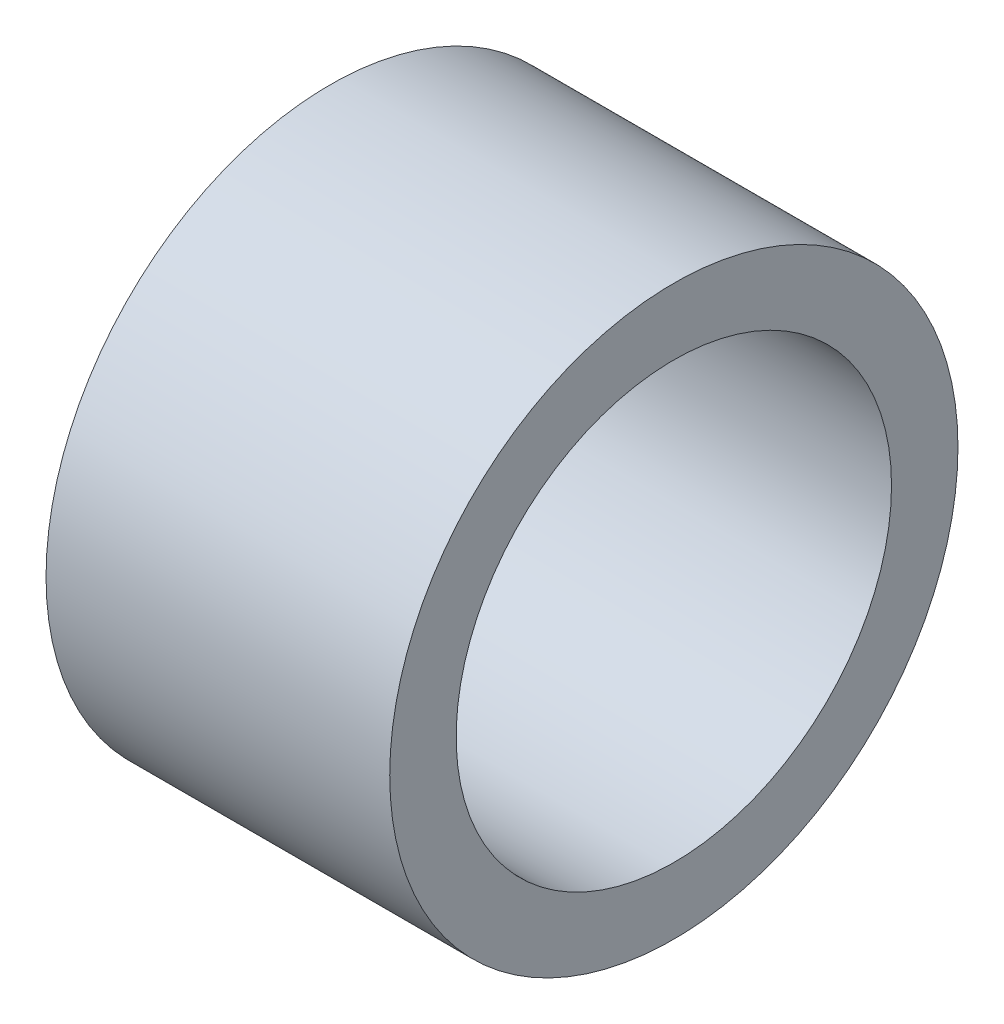
ISO-10303-21;
HEADER;
FILE_DESCRIPTION(('STEP AP214'),'2;1');
FILE_NAME('part.step','',(''),(''),'','','');
FILE_SCHEMA(('AUTOMOTIVE_DESIGN { 1 0 10303 214 1 1 1 1 }'));
ENDSEC;
DATA;
#1=APPLICATION_CONTEXT('core data for automotive mechanical design processes');
#2=APPLICATION_PROTOCOL_DEFINITION('international standard','automotive_design',2000,#1);
#3=PRODUCT_CONTEXT('',#1,'mechanical');
#4=PRODUCT('Part','Part','',(#3));
#5=PRODUCT_RELATED_PRODUCT_CATEGORY('part','',(#4));
#6=PRODUCT_DEFINITION_FORMATION('','',#4);
#7=PRODUCT_DEFINITION_CONTEXT('part definition',#1,'design');
#8=PRODUCT_DEFINITION('design','',#6,#7);
#9=PRODUCT_DEFINITION_SHAPE('','',#8);
#10=(LENGTH_UNIT() NAMED_UNIT(*) SI_UNIT(.MILLI.,.METRE.));
#11=(NAMED_UNIT(*) PLANE_ANGLE_UNIT() SI_UNIT($,.RADIAN.));
#12=(NAMED_UNIT(*) SI_UNIT($,.STERADIAN.) SOLID_ANGLE_UNIT());
#13=UNCERTAINTY_MEASURE_WITH_UNIT(LENGTH_MEASURE(1.E-05),#10,'distance_accuracy_value','');
#14=(GEOMETRIC_REPRESENTATION_CONTEXT(3) GLOBAL_UNCERTAINTY_ASSIGNED_CONTEXT((#13)) GLOBAL_UNIT_ASSIGNED_CONTEXT((#10,
#11,#12)) REPRESENTATION_CONTEXT('',''));
#15=CARTESIAN_POINT('',(0.,0.,0.));
#16=DIRECTION('',(0.,0.,1.));
#17=DIRECTION('',(1.,0.,0.));
#18=AXIS2_PLACEMENT_3D('',#15,#16,#17);
#19=CARTESIAN_POINT('',(0.,0.,0.));
#20=DIRECTION('',(1.,0.,0.));
#21=DIRECTION('',(0.,0.,-1.));
#22=AXIS2_PLACEMENT_3D('',#19,#20,#21);
#23=CYLINDRICAL_SURFACE('',#22,4.75);
#24=CARTESIAN_POINT('',(0.,0.,0.));
#25=DIRECTION('',(1.,0.,0.));
#26=DIRECTION('',(0.,0.,-1.));
#27=AXIS2_PLACEMENT_3D('',#24,#25,#26);
#28=CIRCLE('',#27,4.75);
#29=CARTESIAN_POINT('',(0.,0.,-4.75));
#30=VERTEX_POINT('',#29);
#31=EDGE_CURVE('E10',#30,#30,#28,.T.);
#32=ORIENTED_EDGE('',*,*,#31,.T.);
#33=EDGE_LOOP('',(#32));
#34=FACE_BOUND('',#33,.T.);
#35=CARTESIAN_POINT('',(-7.5,0.,0.));
#36=DIRECTION('',(1.,0.,0.));
#37=DIRECTION('',(0.,0.,-1.));
#38=AXIS2_PLACEMENT_3D('',#35,#36,#37);
#39=CIRCLE('',#38,4.75);
#40=CARTESIAN_POINT('',(-7.5,0.,-4.75));
#41=VERTEX_POINT('',#40);
#42=EDGE_CURVE('E38',#41,#41,#39,.T.);
#43=ORIENTED_EDGE('',*,*,#42,.F.);
#44=EDGE_LOOP('',(#43));
#45=FACE_BOUND('',#44,.T.);
#46=ADVANCED_FACE('F24',(#34,#45),#23,.F.);
#47=CARTESIAN_POINT('',(0.,4.75,0.));
#48=DIRECTION('',(1.,0.,0.));
#49=DIRECTION('',(0.,0.,-1.));
#50=AXIS2_PLACEMENT_3D('',#47,#48,#49);
#51=PLANE('',#50);
#52=CARTESIAN_POINT('',(0.,0.,0.));
#53=DIRECTION('',(1.,0.,0.));
#54=DIRECTION('',(0.,0.,-1.));
#55=AXIS2_PLACEMENT_3D('',#52,#53,#54);
#56=CIRCLE('',#55,6.2);
#57=CARTESIAN_POINT('',(0.,0.,-6.2));
#58=VERTEX_POINT('',#57);
#59=EDGE_CURVE('E30',#58,#58,#56,.T.);
#60=ORIENTED_EDGE('',*,*,#59,.T.);
#61=EDGE_LOOP('',(#60));
#62=FACE_BOUND('',#61,.T.);
#63=ORIENTED_EDGE('',*,*,#31,.F.);
#64=EDGE_LOOP('',(#63));
#65=FACE_BOUND('',#64,.T.);
#66=ADVANCED_FACE('F48',(#62,#65),#51,.T.);
#67=CARTESIAN_POINT('',(0.,0.,0.));
#68=DIRECTION('',(1.,0.,0.));
#69=DIRECTION('',(0.,0.,-1.));
#70=AXIS2_PLACEMENT_3D('',#67,#68,#69);
#71=CYLINDRICAL_SURFACE('',#70,6.2);
#72=CARTESIAN_POINT('',(-7.5,0.,0.));
#73=DIRECTION('',(1.,0.,0.));
#74=DIRECTION('',(0.,0.,-1.));
#75=AXIS2_PLACEMENT_3D('',#72,#73,#74);
#76=CIRCLE('',#75,6.2);
#77=CARTESIAN_POINT('',(-7.5,0.,-6.2));
#78=VERTEX_POINT('',#77);
#79=EDGE_CURVE('E34',#78,#78,#76,.T.);
#80=ORIENTED_EDGE('',*,*,#79,.T.);
#81=EDGE_LOOP('',(#80));
#82=FACE_BOUND('',#81,.T.);
#83=ORIENTED_EDGE('',*,*,#59,.F.);
#84=EDGE_LOOP('',(#83));
#85=FACE_BOUND('',#84,.T.);
#86=ADVANCED_FACE('F52',(#82,#85),#71,.T.);
#87=CARTESIAN_POINT('',(-7.5,6.2,0.));
#88=DIRECTION('',(-1.,0.,0.));
#89=DIRECTION('',(0.,0.,1.));
#90=AXIS2_PLACEMENT_3D('',#87,#88,#89);
#91=PLANE('',#90);
#92=ORIENTED_EDGE('',*,*,#42,.T.);
#93=EDGE_LOOP('',(#92));
#94=FACE_BOUND('',#93,.T.);
#95=ORIENTED_EDGE('',*,*,#79,.F.);
#96=EDGE_LOOP('',(#95));
#97=FACE_BOUND('',#96,.T.);
#98=ADVANCED_FACE('F44',(#94,#97),#91,.T.);
#99=CLOSED_SHELL('',(#46,#66,#86,#98));
#100=MANIFOLD_SOLID_BREP('B2',#99);
#101=ADVANCED_BREP_SHAPE_REPRESENTATION('',(#18,#100),#14);
#102=SHAPE_DEFINITION_REPRESENTATION(#9,#101);
ENDSEC;
END-ISO-10303-21;
